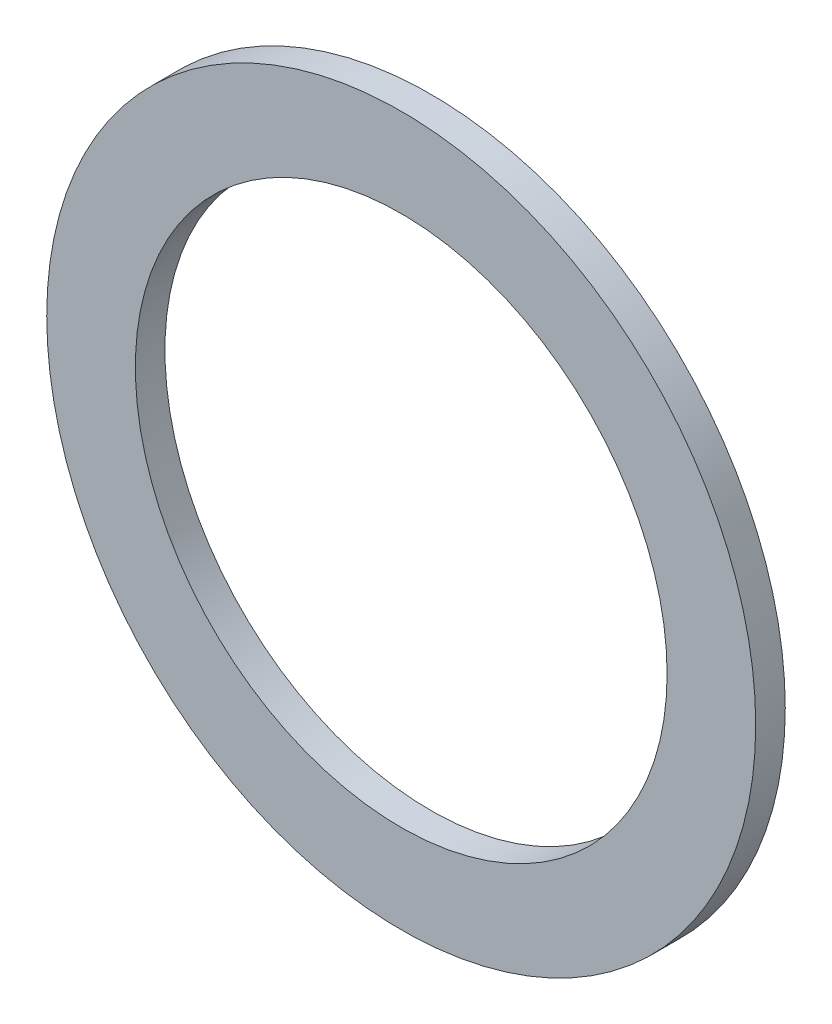
ISO-10303-21;
HEADER;
FILE_DESCRIPTION(('STEP AP214'),'2;1');
FILE_NAME('part.step','',(''),(''),'','','');
FILE_SCHEMA(('AUTOMOTIVE_DESIGN { 1 0 10303 214 1 1 1 1 }'));
ENDSEC;
DATA;
#1=APPLICATION_CONTEXT('core data for automotive mechanical design processes');
#2=APPLICATION_PROTOCOL_DEFINITION('international standard','automotive_design',2000,#1);
#3=PRODUCT_CONTEXT('',#1,'mechanical');
#4=PRODUCT('Part','Part','',(#3));
#5=PRODUCT_RELATED_PRODUCT_CATEGORY('part','',(#4));
#6=PRODUCT_DEFINITION_FORMATION('','',#4);
#7=PRODUCT_DEFINITION_CONTEXT('part definition',#1,'design');
#8=PRODUCT_DEFINITION('design','',#6,#7);
#9=PRODUCT_DEFINITION_SHAPE('','',#8);
#10=(LENGTH_UNIT() NAMED_UNIT(*) SI_UNIT(.MILLI.,.METRE.));
#11=(NAMED_UNIT(*) PLANE_ANGLE_UNIT() SI_UNIT($,.RADIAN.));
#12=(NAMED_UNIT(*) SI_UNIT($,.STERADIAN.) SOLID_ANGLE_UNIT());
#13=UNCERTAINTY_MEASURE_WITH_UNIT(LENGTH_MEASURE(1.E-05),#10,'distance_accuracy_value','');
#14=(GEOMETRIC_REPRESENTATION_CONTEXT(3) GLOBAL_UNCERTAINTY_ASSIGNED_CONTEXT((#13)) GLOBAL_UNIT_ASSIGNED_CONTEXT((#10,
#11,#12)) REPRESENTATION_CONTEXT('',''));
#15=CARTESIAN_POINT('',(0.,0.,0.));
#16=DIRECTION('',(0.,0.,1.));
#17=DIRECTION('',(1.,0.,0.));
#18=AXIS2_PLACEMENT_3D('',#15,#16,#17);
#19=CARTESIAN_POINT('',(0.,0.,3.175));
#20=DIRECTION('',(0.,0.,1.));
#21=DIRECTION('',(1.,0.,0.));
#22=AXIS2_PLACEMENT_3D('',#19,#20,#21);
#23=PLANE('',#22);
#24=CARTESIAN_POINT('',(0.,0.,3.175));
#25=DIRECTION('',(0.,0.,1.));
#26=DIRECTION('',(1.,0.,0.));
#27=AXIS2_PLACEMENT_3D('',#24,#25,#26);
#28=CIRCLE('',#27,38.1);
#29=CARTESIAN_POINT('',(38.1,0.,3.175));
#30=VERTEX_POINT('',#29);
#31=EDGE_CURVE('E10',#30,#30,#28,.T.);
#32=ORIENTED_EDGE('',*,*,#31,.T.);
#33=EDGE_LOOP('',(#32));
#34=FACE_BOUND('',#33,.T.);
#35=CARTESIAN_POINT('',(0.,0.,3.175));
#36=DIRECTION('',(0.,0.,1.));
#37=DIRECTION('',(1.,0.,0.));
#38=AXIS2_PLACEMENT_3D('',#35,#36,#37);
#39=CIRCLE('',#38,28.575);
#40=CARTESIAN_POINT('',(28.575,0.,3.175));
#41=VERTEX_POINT('',#40);
#42=EDGE_CURVE('E48',#41,#41,#39,.T.);
#43=ORIENTED_EDGE('',*,*,#42,.F.);
#44=EDGE_LOOP('',(#43));
#45=FACE_BOUND('',#44,.T.);
#46=ADVANCED_FACE('F37',(#34,#45),#23,.T.);
#47=CARTESIAN_POINT('',(0.,0.,0.));
#48=DIRECTION('',(0.,0.,1.));
#49=DIRECTION('',(1.,0.,0.));
#50=AXIS2_PLACEMENT_3D('',#47,#48,#49);
#51=PLANE('',#50);
#52=CARTESIAN_POINT('',(0.,0.,0.));
#53=DIRECTION('',(0.,0.,1.));
#54=DIRECTION('',(1.,0.,0.));
#55=AXIS2_PLACEMENT_3D('',#52,#53,#54);
#56=CIRCLE('',#55,38.1);
#57=CARTESIAN_POINT('',(38.1,0.,0.));
#58=VERTEX_POINT('',#57);
#59=EDGE_CURVE('E41',#58,#58,#56,.T.);
#60=ORIENTED_EDGE('',*,*,#59,.F.);
#61=EDGE_LOOP('',(#60));
#62=FACE_BOUND('',#61,.T.);
#63=CARTESIAN_POINT('',(0.,0.,0.));
#64=DIRECTION('',(0.,0.,1.));
#65=DIRECTION('',(1.,0.,0.));
#66=AXIS2_PLACEMENT_3D('',#63,#64,#65);
#67=CIRCLE('',#66,28.575);
#68=CARTESIAN_POINT('',(28.575,0.,0.));
#69=VERTEX_POINT('',#68);
#70=EDGE_CURVE('E50',#69,#69,#67,.T.);
#71=ORIENTED_EDGE('',*,*,#70,.T.);
#72=EDGE_LOOP('',(#71));
#73=FACE_BOUND('',#72,.T.);
#74=ADVANCED_FACE('F60',(#62,#73),#51,.F.);
#75=CARTESIAN_POINT('',(0.,0.,3.175));
#76=DIRECTION('',(0.,0.,-1.));
#77=DIRECTION('',(-1.,0.,0.));
#78=AXIS2_PLACEMENT_3D('',#75,#76,#77);
#79=CYLINDRICAL_SURFACE('',#78,38.1);
#80=ORIENTED_EDGE('',*,*,#31,.F.);
#81=EDGE_LOOP('',(#80));
#82=FACE_BOUND('',#81,.T.);
#83=ORIENTED_EDGE('',*,*,#59,.T.);
#84=EDGE_LOOP('',(#83));
#85=FACE_BOUND('',#84,.T.);
#86=ADVANCED_FACE('F39',(#82,#85),#79,.T.);
#87=CARTESIAN_POINT('',(0.,0.,3.175));
#88=DIRECTION('',(0.,0.,-1.));
#89=DIRECTION('',(-1.,0.,0.));
#90=AXIS2_PLACEMENT_3D('',#87,#88,#89);
#91=CYLINDRICAL_SURFACE('',#90,28.575);
#92=ORIENTED_EDGE('',*,*,#42,.T.);
#93=EDGE_LOOP('',(#92));
#94=FACE_BOUND('',#93,.T.);
#95=ORIENTED_EDGE('',*,*,#70,.F.);
#96=EDGE_LOOP('',(#95));
#97=FACE_BOUND('',#96,.T.);
#98=ADVANCED_FACE('F56',(#94,#97),#91,.F.);
#99=CLOSED_SHELL('',(#46,#74,#86,#98));
#100=MANIFOLD_SOLID_BREP('B2',#99);
#101=ADVANCED_BREP_SHAPE_REPRESENTATION('',(#18,#100),#14);
#102=SHAPE_DEFINITION_REPRESENTATION(#9,#101);
ENDSEC;
END-ISO-10303-21;
